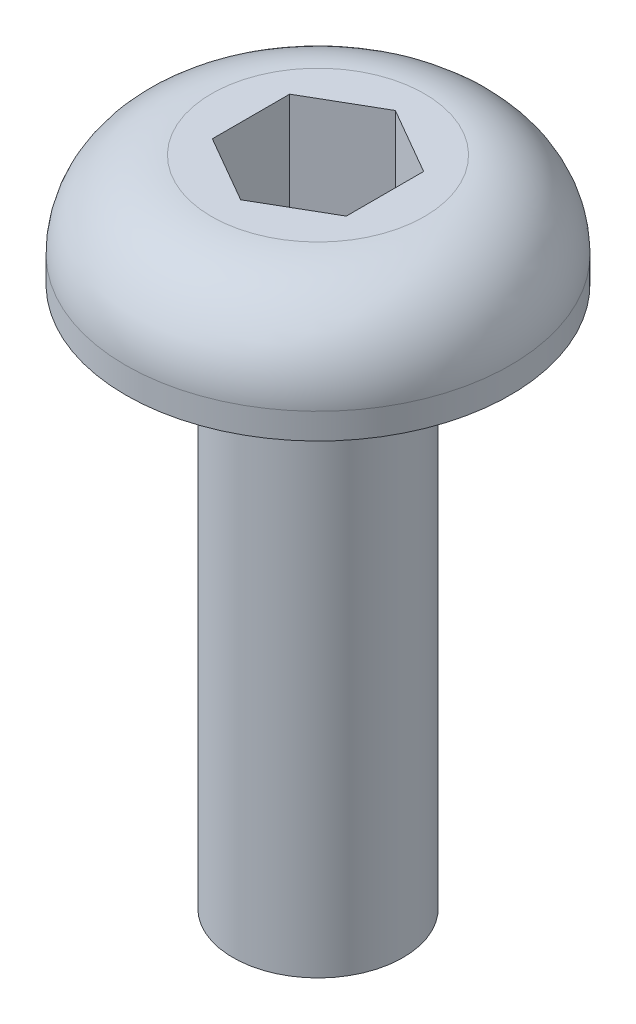
ISO-10303-21;
HEADER;
FILE_DESCRIPTION(('STEP AP214'),'2;1');
FILE_NAME('part.step','',(''),(''),'','','');
FILE_SCHEMA(('AUTOMOTIVE_DESIGN { 1 0 10303 214 1 1 1 1 }'));
ENDSEC;
DATA;
#1=APPLICATION_CONTEXT('core data for automotive mechanical design processes');
#2=APPLICATION_PROTOCOL_DEFINITION('international standard','automotive_design',2000,#1);
#3=PRODUCT_CONTEXT('',#1,'mechanical');
#4=PRODUCT('Part','Part','',(#3));
#5=PRODUCT_RELATED_PRODUCT_CATEGORY('part','',(#4));
#6=PRODUCT_DEFINITION_FORMATION('','',#4);
#7=PRODUCT_DEFINITION_CONTEXT('part definition',#1,'design');
#8=PRODUCT_DEFINITION('design','',#6,#7);
#9=PRODUCT_DEFINITION_SHAPE('','',#8);
#10=(LENGTH_UNIT() NAMED_UNIT(*) SI_UNIT(.MILLI.,.METRE.));
#11=(NAMED_UNIT(*) PLANE_ANGLE_UNIT() SI_UNIT($,.RADIAN.));
#12=(NAMED_UNIT(*) SI_UNIT($,.STERADIAN.) SOLID_ANGLE_UNIT());
#13=UNCERTAINTY_MEASURE_WITH_UNIT(LENGTH_MEASURE(1.E-05),#10,'distance_accuracy_value','');
#14=(GEOMETRIC_REPRESENTATION_CONTEXT(3) GLOBAL_UNCERTAINTY_ASSIGNED_CONTEXT((#13)) GLOBAL_UNIT_ASSIGNED_CONTEXT((#10,
#11,#12)) REPRESENTATION_CONTEXT('',''));
#15=CARTESIAN_POINT('',(0.,0.,0.));
#16=DIRECTION('',(0.,0.,1.));
#17=DIRECTION('',(1.,0.,0.));
#18=AXIS2_PLACEMENT_3D('',#15,#16,#17);
#19=CARTESIAN_POINT('',(0.,0.,0.));
#20=DIRECTION('',(0.,1.,0.));
#21=DIRECTION('',(0.,0.,1.));
#22=AXIS2_PLACEMENT_3D('',#19,#20,#21);
#23=PLANE('',#22);
#24=DIRECTION('',(0.,0.,1.));
#25=VECTOR('',#24,1.);
#26=CARTESIAN_POINT('',(-0.9906,0.,-0.571923176659243));
#27=LINE('',#26,#25);
#28=CARTESIAN_POINT('',(-0.9906,0.,-0.571923176659243));
#29=VERTEX_POINT('',#28);
#30=CARTESIAN_POINT('',(-0.9906,0.,0.571923176659243));
#31=VERTEX_POINT('',#30);
#32=EDGE_CURVE('E81',#29,#31,#27,.T.);
#33=ORIENTED_EDGE('',*,*,#32,.T.);
#34=DIRECTION('',(0.866025403784439,0.,0.5));
#35=VECTOR('',#34,1.);
#36=CARTESIAN_POINT('',(-0.9906,0.,0.571923176659243));
#37=LINE('',#36,#35);
#38=CARTESIAN_POINT('',(0.,0.,1.14384635331849));
#39=VERTEX_POINT('',#38);
#40=EDGE_CURVE('E65',#31,#39,#37,.T.);
#41=ORIENTED_EDGE('',*,*,#40,.T.);
#42=DIRECTION('',(0.866025403784439,0.,-0.5));
#43=VECTOR('',#42,1.);
#44=CARTESIAN_POINT('',(0.,0.,1.14384635331849));
#45=LINE('',#44,#43);
#46=CARTESIAN_POINT('',(0.9906,0.,0.571923176659243));
#47=VERTEX_POINT('',#46);
#48=EDGE_CURVE('E70',#39,#47,#45,.T.);
#49=ORIENTED_EDGE('',*,*,#48,.T.);
#50=DIRECTION('',(0.,0.,-1.));
#51=VECTOR('',#50,1.);
#52=CARTESIAN_POINT('',(0.9906,0.,0.571923176659243));
#53=LINE('',#52,#51);
#54=CARTESIAN_POINT('',(0.9906,0.,-0.571923176659243));
#55=VERTEX_POINT('',#54);
#56=EDGE_CURVE('E130',#47,#55,#53,.T.);
#57=ORIENTED_EDGE('',*,*,#56,.T.);
#58=DIRECTION('',(-0.866025403784439,0.,-0.5));
#59=VECTOR('',#58,1.);
#60=CARTESIAN_POINT('',(0.9906,0.,-0.571923176659243));
#61=LINE('',#60,#59);
#62=CARTESIAN_POINT('',(0.,0.,-1.14384635331849));
#63=VERTEX_POINT('',#62);
#64=EDGE_CURVE('E140',#55,#63,#61,.T.);
#65=ORIENTED_EDGE('',*,*,#64,.T.);
#66=DIRECTION('',(-0.866025403784439,0.,0.5));
#67=VECTOR('',#66,1.);
#68=CARTESIAN_POINT('',(0.,0.,-1.14384635331849));
#69=LINE('',#68,#67);
#70=EDGE_CURVE('E145',#63,#29,#69,.T.);
#71=ORIENTED_EDGE('',*,*,#70,.T.);
#72=EDGE_LOOP('',(#33,#41,#49,#57,#65,#71));
#73=FACE_BOUND('',#72,.T.);
#74=ADVANCED_FACE('F15',(#73),#23,.T.);
#75=CARTESIAN_POINT('',(0.,0.,1.14384635331849));
#76=DIRECTION('',(0.5,0.,0.866025403784439));
#77=DIRECTION('',(0.866025403784439,0.,-0.5));
#78=AXIS2_PLACEMENT_3D('',#75,#76,#77);
#79=PLANE('',#78);
#80=DIRECTION('',(0.,1.,0.));
#81=VECTOR('',#80,1.);
#82=CARTESIAN_POINT('',(0.,0.,1.14384635331849));
#83=LINE('',#82,#81);
#84=CARTESIAN_POINT('',(0.,1.651,1.14384635331849));
#85=VERTEX_POINT('',#84);
#86=EDGE_CURVE('E72',#39,#85,#83,.T.);
#87=ORIENTED_EDGE('',*,*,#86,.T.);
#88=DIRECTION('',(-0.866025403784439,0.,0.5));
#89=VECTOR('',#88,1.);
#90=CARTESIAN_POINT('',(0.9906,1.651,0.571923176659243));
#91=LINE('',#90,#89);
#92=CARTESIAN_POINT('',(0.9906,1.651,0.571923176659243));
#93=VERTEX_POINT('',#92);
#94=EDGE_CURVE('E137',#93,#85,#91,.T.);
#95=ORIENTED_EDGE('',*,*,#94,.F.);
#96=DIRECTION('',(0.,1.,0.));
#97=VECTOR('',#96,1.);
#98=CARTESIAN_POINT('',(0.9906,0.,0.571923176659243));
#99=LINE('',#98,#97);
#100=EDGE_CURVE('E75',#93,#47,#99,.F.);
#101=ORIENTED_EDGE('',*,*,#100,.T.);
#102=ORIENTED_EDGE('',*,*,#48,.F.);
#103=EDGE_LOOP('',(#87,#95,#101,#102));
#104=FACE_BOUND('',#103,.T.);
#105=ADVANCED_FACE('F71',(#104),#79,.F.);
#106=CARTESIAN_POINT('',(-0.9906,0.,0.571923176659243));
#107=DIRECTION('',(-0.5,0.,0.866025403784439));
#108=DIRECTION('',(0.866025403784439,0.,0.5));
#109=AXIS2_PLACEMENT_3D('',#106,#107,#108);
#110=PLANE('',#109);
#111=DIRECTION('',(0.,1.,0.));
#112=VECTOR('',#111,1.);
#113=CARTESIAN_POINT('',(-0.9906,0.,0.571923176659243));
#114=LINE('',#113,#112);
#115=CARTESIAN_POINT('',(-0.9906,1.651,0.571923176659243));
#116=VERTEX_POINT('',#115);
#117=EDGE_CURVE('E83',#31,#116,#114,.T.);
#118=ORIENTED_EDGE('',*,*,#117,.T.);
#119=DIRECTION('',(-0.866025403784439,0.,-0.5));
#120=VECTOR('',#119,1.);
#121=CARTESIAN_POINT('',(0.,1.651,1.14384635331849));
#122=LINE('',#121,#120);
#123=EDGE_CURVE('E87',#85,#116,#122,.T.);
#124=ORIENTED_EDGE('',*,*,#123,.F.);
#125=ORIENTED_EDGE('',*,*,#86,.F.);
#126=ORIENTED_EDGE('',*,*,#40,.F.);
#127=EDGE_LOOP('',(#118,#124,#125,#126));
#128=FACE_BOUND('',#127,.T.);
#129=ADVANCED_FACE('F85',(#128),#110,.F.);
#130=CARTESIAN_POINT('',(-0.9906,0.,-0.571923176659243));
#131=DIRECTION('',(-1.,0.,0.));
#132=DIRECTION('',(0.,0.,1.));
#133=AXIS2_PLACEMENT_3D('',#130,#131,#132);
#134=PLANE('',#133);
#135=DIRECTION('',(0.,1.,0.));
#136=VECTOR('',#135,1.);
#137=CARTESIAN_POINT('',(-0.9906,0.,-0.571923176659243));
#138=LINE('',#137,#136);
#139=CARTESIAN_POINT('',(-0.9906,1.651,-0.571923176659243));
#140=VERTEX_POINT('',#139);
#141=EDGE_CURVE('E147',#29,#140,#138,.T.);
#142=ORIENTED_EDGE('',*,*,#141,.T.);
#143=DIRECTION('',(0.,0.,1.));
#144=VECTOR('',#143,1.);
#145=CARTESIAN_POINT('',(-0.9906,1.651,0.));
#146=LINE('',#145,#144);
#147=EDGE_CURVE('E152',#116,#140,#146,.F.);
#148=ORIENTED_EDGE('',*,*,#147,.F.);
#149=ORIENTED_EDGE('',*,*,#117,.F.);
#150=ORIENTED_EDGE('',*,*,#32,.F.);
#151=EDGE_LOOP('',(#142,#148,#149,#150));
#152=FACE_BOUND('',#151,.T.);
#153=ADVANCED_FACE('F153',(#152),#134,.F.);
#154=CARTESIAN_POINT('',(0.,0.,-1.14384635331849));
#155=DIRECTION('',(-0.5,0.,-0.866025403784439));
#156=DIRECTION('',(-0.866025403784439,0.,0.5));
#157=AXIS2_PLACEMENT_3D('',#154,#155,#156);
#158=PLANE('',#157);
#159=DIRECTION('',(0.,1.,0.));
#160=VECTOR('',#159,1.);
#161=CARTESIAN_POINT('',(0.,0.,-1.14384635331849));
#162=LINE('',#161,#160);
#163=CARTESIAN_POINT('',(0.,1.651,-1.14384635331849));
#164=VERTEX_POINT('',#163);
#165=EDGE_CURVE('E143',#63,#164,#162,.T.);
#166=ORIENTED_EDGE('',*,*,#165,.T.);
#167=DIRECTION('',(0.866025403784439,0.,-0.5));
#168=VECTOR('',#167,1.);
#169=CARTESIAN_POINT('',(-0.9906,1.651,-0.571923176659243));
#170=LINE('',#169,#168);
#171=EDGE_CURVE('E158',#140,#164,#170,.T.);
#172=ORIENTED_EDGE('',*,*,#171,.F.);
#173=ORIENTED_EDGE('',*,*,#141,.F.);
#174=ORIENTED_EDGE('',*,*,#70,.F.);
#175=EDGE_LOOP('',(#166,#172,#173,#174));
#176=FACE_BOUND('',#175,.T.);
#177=ADVANCED_FACE('F180',(#176),#158,.F.);
#178=CARTESIAN_POINT('',(0.9906,0.,-0.571923176659243));
#179=DIRECTION('',(0.5,0.,-0.866025403784439));
#180=DIRECTION('',(-0.866025403784439,0.,-0.5));
#181=AXIS2_PLACEMENT_3D('',#178,#179,#180);
#182=PLANE('',#181);
#183=DIRECTION('',(0.,1.,0.));
#184=VECTOR('',#183,1.);
#185=CARTESIAN_POINT('',(0.9906,0.,-0.571923176659243));
#186=LINE('',#185,#184);
#187=CARTESIAN_POINT('',(0.9906,1.651,-0.571923176659243));
#188=VERTEX_POINT('',#187);
#189=EDGE_CURVE('E33',#55,#188,#186,.T.);
#190=ORIENTED_EDGE('',*,*,#189,.T.);
#191=DIRECTION('',(0.866025403784439,0.,0.5));
#192=VECTOR('',#191,1.);
#193=CARTESIAN_POINT('',(0.,1.651,-1.14384635331849));
#194=LINE('',#193,#192);
#195=EDGE_CURVE('E166',#164,#188,#194,.T.);
#196=ORIENTED_EDGE('',*,*,#195,.F.);
#197=ORIENTED_EDGE('',*,*,#165,.F.);
#198=ORIENTED_EDGE('',*,*,#64,.F.);
#199=EDGE_LOOP('',(#190,#196,#197,#198));
#200=FACE_BOUND('',#199,.T.);
#201=ADVANCED_FACE('F178',(#200),#182,.F.);
#202=CARTESIAN_POINT('',(0.9906,0.,0.571923176659243));
#203=DIRECTION('',(1.,0.,0.));
#204=DIRECTION('',(0.,0.,-1.));
#205=AXIS2_PLACEMENT_3D('',#202,#203,#204);
#206=PLANE('',#205);
#207=ORIENTED_EDGE('',*,*,#100,.F.);
#208=DIRECTION('',(0.,0.,1.));
#209=VECTOR('',#208,1.);
#210=CARTESIAN_POINT('',(0.9906,1.651,0.));
#211=LINE('',#210,#209);
#212=EDGE_CURVE('E104',#188,#93,#211,.T.);
#213=ORIENTED_EDGE('',*,*,#212,.F.);
#214=ORIENTED_EDGE('',*,*,#189,.F.);
#215=ORIENTED_EDGE('',*,*,#56,.F.);
#216=EDGE_LOOP('',(#207,#213,#214,#215));
#217=FACE_BOUND('',#216,.T.);
#218=ADVANCED_FACE('F176',(#217),#206,.F.);
#219=CARTESIAN_POINT('',(0.,1.651,0.));
#220=DIRECTION('',(0.,1.,0.));
#221=DIRECTION('',(0.,0.,1.));
#222=AXIS2_PLACEMENT_3D('',#219,#220,#221);
#223=PLANE('',#222);
#224=ORIENTED_EDGE('',*,*,#195,.T.);
#225=ORIENTED_EDGE('',*,*,#212,.T.);
#226=ORIENTED_EDGE('',*,*,#94,.T.);
#227=ORIENTED_EDGE('',*,*,#123,.T.);
#228=ORIENTED_EDGE('',*,*,#147,.T.);
#229=ORIENTED_EDGE('',*,*,#171,.T.);
#230=EDGE_LOOP('',(#224,#225,#226,#227,#228,#229));
#231=FACE_BOUND('',#230,.T.);
#232=CARTESIAN_POINT('',(0.,1.651,0.));
#233=DIRECTION('',(0.,-1.,0.));
#234=DIRECTION('',(1.,0.,0.));
#235=AXIS2_PLACEMENT_3D('',#232,#233,#234);
#236=CIRCLE('',#235,1.5748);
#237=CARTESIAN_POINT('',(1.5748,1.651,0.));
#238=VERTEX_POINT('',#237);
#239=EDGE_CURVE('E99',#238,#238,#236,.T.);
#240=ORIENTED_EDGE('',*,*,#239,.F.);
#241=EDGE_LOOP('',(#240));
#242=FACE_BOUND('',#241,.T.);
#243=ADVANCED_FACE('F119',(#231,#242),#223,.T.);
#244=CARTESIAN_POINT('',(0.,0.381,0.));
#245=DIRECTION('',(0.,1.,0.));
#246=DIRECTION('',(0.,0.,1.));
#247=AXIS2_PLACEMENT_3D('',#244,#245,#246);
#248=TOROIDAL_SURFACE('',#247,1.5748,1.27);
#249=ORIENTED_EDGE('',*,*,#239,.T.);
#250=EDGE_LOOP('',(#249));
#251=FACE_BOUND('',#250,.T.);
#252=CARTESIAN_POINT('',(0.,0.381,0.));
#253=DIRECTION('',(0.,1.,0.));
#254=DIRECTION('',(0.,0.,1.));
#255=AXIS2_PLACEMENT_3D('',#252,#253,#254);
#256=CIRCLE('',#255,2.8448);
#257=CARTESIAN_POINT('',(0.,0.381,2.8448));
#258=VERTEX_POINT('',#257);
#259=EDGE_CURVE('E95',#258,#258,#256,.F.);
#260=ORIENTED_EDGE('',*,*,#259,.F.);
#261=EDGE_LOOP('',(#260));
#262=FACE_BOUND('',#261,.T.);
#263=ADVANCED_FACE('F113',(#251,#262),#248,.T.);
#264=CARTESIAN_POINT('',(0.,0.,0.));
#265=DIRECTION('',(0.,1.,0.));
#266=DIRECTION('',(0.,0.,1.));
#267=AXIS2_PLACEMENT_3D('',#264,#265,#266);
#268=CYLINDRICAL_SURFACE('',#267,2.8448);
#269=ORIENTED_EDGE('',*,*,#259,.T.);
#270=EDGE_LOOP('',(#269));
#271=FACE_BOUND('',#270,.T.);
#272=CARTESIAN_POINT('',(0.,0.,0.));
#273=DIRECTION('',(0.,1.,0.));
#274=DIRECTION('',(0.,0.,1.));
#275=AXIS2_PLACEMENT_3D('',#272,#273,#274);
#276=CIRCLE('',#275,2.8448);
#277=CARTESIAN_POINT('',(0.,0.,2.8448));
#278=VERTEX_POINT('',#277);
#279=EDGE_CURVE('E18',#278,#278,#276,.T.);
#280=ORIENTED_EDGE('',*,*,#279,.T.);
#281=EDGE_LOOP('',(#280));
#282=FACE_BOUND('',#281,.T.);
#283=ADVANCED_FACE('F118',(#271,#282),#268,.T.);
#284=CARTESIAN_POINT('',(0.,-8.,0.));
#285=DIRECTION('',(0.,1.,0.));
#286=DIRECTION('',(0.,0.,1.));
#287=AXIS2_PLACEMENT_3D('',#284,#285,#286);
#288=PLANE('',#287);
#289=CARTESIAN_POINT('',(0.,-8.,0.));
#290=DIRECTION('',(0.,-1.,0.));
#291=DIRECTION('',(0.,0.,-1.));
#292=AXIS2_PLACEMENT_3D('',#289,#290,#291);
#293=CIRCLE('',#292,1.2573);
#294=CARTESIAN_POINT('',(0.,-8.,-1.2573));
#295=VERTEX_POINT('',#294);
#296=EDGE_CURVE('E24',#295,#295,#293,.F.);
#297=ORIENTED_EDGE('',*,*,#296,.F.);
#298=EDGE_LOOP('',(#297));
#299=FACE_BOUND('',#298,.T.);
#300=ADVANCED_FACE('F198',(#299),#288,.F.);
#301=CARTESIAN_POINT('',(0.,0.,0.));
#302=DIRECTION('',(0.,1.,0.));
#303=DIRECTION('',(0.,0.,1.));
#304=AXIS2_PLACEMENT_3D('',#301,#302,#303);
#305=PLANE('',#304);
#306=CARTESIAN_POINT('',(0.,0.,0.));
#307=DIRECTION('',(0.,-1.,0.));
#308=DIRECTION('',(0.,0.,-1.));
#309=AXIS2_PLACEMENT_3D('',#306,#307,#308);
#310=CIRCLE('',#309,1.2573);
#311=CARTESIAN_POINT('',(0.,0.,-1.2573));
#312=VERTEX_POINT('',#311);
#313=EDGE_CURVE('E10',#312,#312,#310,.T.);
#314=ORIENTED_EDGE('',*,*,#313,.F.);
#315=EDGE_LOOP('',(#314));
#316=FACE_BOUND('',#315,.T.);
#317=ORIENTED_EDGE('',*,*,#279,.F.);
#318=EDGE_LOOP('',(#317));
#319=FACE_BOUND('',#318,.T.);
#320=ADVANCED_FACE('F192',(#316,#319),#305,.F.);
#321=CARTESIAN_POINT('',(0.,0.,0.));
#322=DIRECTION('',(0.,-1.,0.));
#323=DIRECTION('',(0.,0.,-1.));
#324=AXIS2_PLACEMENT_3D('',#321,#322,#323);
#325=CYLINDRICAL_SURFACE('',#324,1.2573);
#326=ORIENTED_EDGE('',*,*,#313,.T.);
#327=EDGE_LOOP('',(#326));
#328=FACE_BOUND('',#327,.T.);
#329=ORIENTED_EDGE('',*,*,#296,.T.);
#330=EDGE_LOOP('',(#329));
#331=FACE_BOUND('',#330,.T.);
#332=ADVANCED_FACE('F190',(#328,#331),#325,.T.);
#333=CLOSED_SHELL('',(#74,#105,#129,#153,#177,#201,#218,#243,#263,#283,#300,#320,#332));
#334=MANIFOLD_SOLID_BREP('B1',#333);
#335=ADVANCED_BREP_SHAPE_REPRESENTATION('',(#18,#334),#14);
#336=SHAPE_DEFINITION_REPRESENTATION(#9,#335);
ENDSEC;
END-ISO-10303-21;
